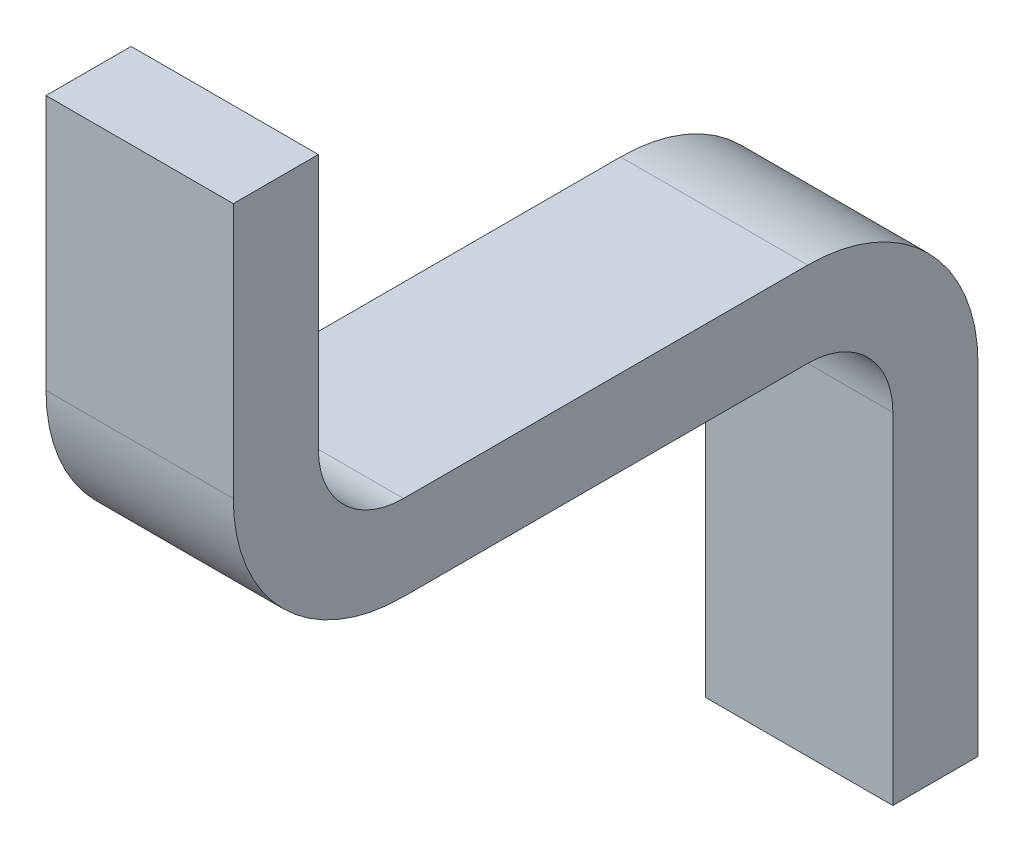
ISO-10303-21;
HEADER;
FILE_DESCRIPTION(('STEP AP214'),'2;1');
FILE_NAME('part.step','',(''),(''),'','','');
FILE_SCHEMA(('AUTOMOTIVE_DESIGN { 1 0 10303 214 1 1 1 1 }'));
ENDSEC;
DATA;
#1=APPLICATION_CONTEXT('core data for automotive mechanical design processes');
#2=APPLICATION_PROTOCOL_DEFINITION('international standard','automotive_design',2000,#1);
#3=PRODUCT_CONTEXT('',#1,'mechanical');
#4=PRODUCT('Part','Part','',(#3));
#5=PRODUCT_RELATED_PRODUCT_CATEGORY('part','',(#4));
#6=PRODUCT_DEFINITION_FORMATION('','',#4);
#7=PRODUCT_DEFINITION_CONTEXT('part definition',#1,'design');
#8=PRODUCT_DEFINITION('design','',#6,#7);
#9=PRODUCT_DEFINITION_SHAPE('','',#8);
#10=(LENGTH_UNIT() NAMED_UNIT(*) SI_UNIT(.MILLI.,.METRE.));
#11=(NAMED_UNIT(*) PLANE_ANGLE_UNIT() SI_UNIT($,.RADIAN.));
#12=(NAMED_UNIT(*) SI_UNIT($,.STERADIAN.) SOLID_ANGLE_UNIT());
#13=UNCERTAINTY_MEASURE_WITH_UNIT(LENGTH_MEASURE(1.E-05),#10,'distance_accuracy_value','');
#14=(GEOMETRIC_REPRESENTATION_CONTEXT(3) GLOBAL_UNCERTAINTY_ASSIGNED_CONTEXT((#13)) GLOBAL_UNIT_ASSIGNED_CONTEXT((#10,
#11,#12)) REPRESENTATION_CONTEXT('',''));
#15=CARTESIAN_POINT('',(0.,0.,0.));
#16=DIRECTION('',(0.,0.,1.));
#17=DIRECTION('',(1.,0.,0.));
#18=AXIS2_PLACEMENT_3D('',#15,#16,#17);
#19=CARTESIAN_POINT('',(-1.36,-4.,0.675));
#20=DIRECTION('',(1.,0.,0.));
#21=DIRECTION('',(0.,1.,0.));
#22=AXIS2_PLACEMENT_3D('',#19,#20,#21);
#23=PLANE('',#22);
#24=CARTESIAN_POINT('',(-1.36,-3.8,0.675));
#25=DIRECTION('',(-1.,0.,0.));
#26=DIRECTION('',(0.,-1.,0.));
#27=AXIS2_PLACEMENT_3D('',#24,#25,#26);
#28=CIRCLE('',#27,0.2);
#29=CARTESIAN_POINT('',(-1.36,-3.8,0.875));
#30=VERTEX_POINT('',#29);
#31=CARTESIAN_POINT('',(-1.36,-4.,0.675));
#32=VERTEX_POINT('',#31);
#33=EDGE_CURVE('E150',#30,#32,#28,.F.);
#34=ORIENTED_EDGE('',*,*,#33,.F.);
#35=DIRECTION('',(0.,1.,0.));
#36=VECTOR('',#35,1.);
#37=CARTESIAN_POINT('',(-1.36,-3.5,0.875));
#38=LINE('',#37,#36);
#39=CARTESIAN_POINT('',(-1.36,-3.5,0.875));
#40=VERTEX_POINT('',#39);
#41=EDGE_CURVE('E147',#30,#40,#38,.T.);
#42=ORIENTED_EDGE('',*,*,#41,.T.);
#43=DIRECTION('',(0.,0.,1.));
#44=VECTOR('',#43,1.);
#45=CARTESIAN_POINT('',(-1.36,-3.5,0.775));
#46=LINE('',#45,#44);
#47=CARTESIAN_POINT('',(-1.36,-3.5,0.775));
#48=VERTEX_POINT('',#47);
#49=EDGE_CURVE('E141',#48,#40,#46,.T.);
#50=ORIENTED_EDGE('',*,*,#49,.F.);
#51=DIRECTION('',(0.,1.,0.));
#52=VECTOR('',#51,1.);
#53=CARTESIAN_POINT('',(-1.36,-3.5,0.775));
#54=LINE('',#53,#52);
#55=CARTESIAN_POINT('',(-1.36,-3.8,0.775));
#56=VERTEX_POINT('',#55);
#57=EDGE_CURVE('E115',#48,#56,#54,.F.);
#58=ORIENTED_EDGE('',*,*,#57,.T.);
#59=CARTESIAN_POINT('',(-1.36,-3.8,0.675));
#60=DIRECTION('',(-1.,0.,0.));
#61=DIRECTION('',(0.,-1.,0.));
#62=AXIS2_PLACEMENT_3D('',#59,#60,#61);
#63=CIRCLE('',#62,0.1);
#64=CARTESIAN_POINT('',(-1.36,-3.9,0.675));
#65=VERTEX_POINT('',#64);
#66=EDGE_CURVE('E215',#56,#65,#63,.F.);
#67=ORIENTED_EDGE('',*,*,#66,.T.);
#68=DIRECTION('',(0.,0.,1.));
#69=VECTOR('',#68,1.);
#70=CARTESIAN_POINT('',(-1.36,-3.9,0.675));
#71=LINE('',#70,#69);
#72=CARTESIAN_POINT('',(-1.36,-3.9,0.2));
#73=VERTEX_POINT('',#72);
#74=EDGE_CURVE('E181',#65,#73,#71,.F.);
#75=ORIENTED_EDGE('',*,*,#74,.T.);
#76=CARTESIAN_POINT('',(-1.36,-4.1,0.2));
#77=DIRECTION('',(1.,0.,0.));
#78=DIRECTION('',(0.,1.,0.));
#79=AXIS2_PLACEMENT_3D('',#76,#77,#78);
#80=CIRCLE('',#79,0.2);
#81=CARTESIAN_POINT('',(-1.36,-4.1,0.));
#82=VERTEX_POINT('',#81);
#83=EDGE_CURVE('E20',#82,#73,#80,.T.);
#84=ORIENTED_EDGE('',*,*,#83,.F.);
#85=DIRECTION('',(0.,1.,0.));
#86=VECTOR('',#85,1.);
#87=CARTESIAN_POINT('',(-1.36,-4.1,0.));
#88=LINE('',#87,#86);
#89=CARTESIAN_POINT('',(-1.36,-4.5,0.));
#90=VERTEX_POINT('',#89);
#91=EDGE_CURVE('E91',#82,#90,#88,.F.);
#92=ORIENTED_EDGE('',*,*,#91,.T.);
#93=DIRECTION('',(0.,0.,1.));
#94=VECTOR('',#93,1.);
#95=CARTESIAN_POINT('',(-1.36,-4.5,0.));
#96=LINE('',#95,#94);
#97=CARTESIAN_POINT('',(-1.36,-4.5,0.1));
#98=VERTEX_POINT('',#97);
#99=EDGE_CURVE('E163',#90,#98,#96,.T.);
#100=ORIENTED_EDGE('',*,*,#99,.T.);
#101=DIRECTION('',(0.,1.,0.));
#102=VECTOR('',#101,1.);
#103=CARTESIAN_POINT('',(-1.36,-4.1,0.1));
#104=LINE('',#103,#102);
#105=CARTESIAN_POINT('',(-1.36,-4.1,0.1));
#106=VERTEX_POINT('',#105);
#107=EDGE_CURVE('E159',#98,#106,#104,.T.);
#108=ORIENTED_EDGE('',*,*,#107,.T.);
#109=CARTESIAN_POINT('',(-1.36,-4.1,0.2));
#110=DIRECTION('',(1.,0.,0.));
#111=DIRECTION('',(0.,1.,0.));
#112=AXIS2_PLACEMENT_3D('',#109,#110,#111);
#113=CIRCLE('',#112,0.1);
#114=CARTESIAN_POINT('',(-1.36,-4.,0.2));
#115=VERTEX_POINT('',#114);
#116=EDGE_CURVE('E155',#106,#115,#113,.T.);
#117=ORIENTED_EDGE('',*,*,#116,.T.);
#118=DIRECTION('',(0.,0.,1.));
#119=VECTOR('',#118,1.);
#120=CARTESIAN_POINT('',(-1.36,-4.,0.675));
#121=LINE('',#120,#119);
#122=EDGE_CURVE('E154',#115,#32,#121,.T.);
#123=ORIENTED_EDGE('',*,*,#122,.T.);
#124=EDGE_LOOP('',(#34,#42,#50,#58,#67,#75,#84,#92,#100,#108,#117,#123));
#125=FACE_BOUND('',#124,.T.);
#126=ADVANCED_FACE('F17',(#125),#23,.F.);
#127=CARTESIAN_POINT('',(-1.36,-4.1,0.2));
#128=DIRECTION('',(1.,0.,0.));
#129=DIRECTION('',(0.,1.,0.));
#130=AXIS2_PLACEMENT_3D('',#127,#128,#129);
#131=CYLINDRICAL_SURFACE('',#130,0.2);
#132=CARTESIAN_POINT('',(-1.14,-4.1,0.2));
#133=DIRECTION('',(1.,0.,0.));
#134=DIRECTION('',(0.,1.,0.));
#135=AXIS2_PLACEMENT_3D('',#132,#133,#134);
#136=CIRCLE('',#135,0.2);
#137=CARTESIAN_POINT('',(-1.14,-3.9,0.2));
#138=VERTEX_POINT('',#137);
#139=CARTESIAN_POINT('',(-1.14,-4.1,0.));
#140=VERTEX_POINT('',#139);
#141=EDGE_CURVE('E183',#138,#140,#136,.F.);
#142=ORIENTED_EDGE('',*,*,#141,.T.);
#143=DIRECTION('',(1.,0.,0.));
#144=VECTOR('',#143,1.);
#145=CARTESIAN_POINT('',(-1.36,-4.1,0.));
#146=LINE('',#145,#144);
#147=EDGE_CURVE('E178',#140,#82,#146,.F.);
#148=ORIENTED_EDGE('',*,*,#147,.T.);
#149=ORIENTED_EDGE('',*,*,#83,.T.);
#150=DIRECTION('',(1.,0.,0.));
#151=VECTOR('',#150,1.);
#152=CARTESIAN_POINT('',(-1.36,-3.9,0.2));
#153=LINE('',#152,#151);
#154=EDGE_CURVE('E217',#73,#138,#153,.T.);
#155=ORIENTED_EDGE('',*,*,#154,.T.);
#156=EDGE_LOOP('',(#142,#148,#149,#155));
#157=FACE_BOUND('',#156,.T.);
#158=ADVANCED_FACE('F254',(#157),#131,.T.);
#159=CARTESIAN_POINT('',(-1.36,-4.1,0.));
#160=DIRECTION('',(0.,0.,1.));
#161=DIRECTION('',(1.,0.,0.));
#162=AXIS2_PLACEMENT_3D('',#159,#160,#161);
#163=PLANE('',#162);
#164=ORIENTED_EDGE('',*,*,#147,.F.);
#165=DIRECTION('',(0.,-1.,0.));
#166=VECTOR('',#165,1.);
#167=CARTESIAN_POINT('',(-1.14,-3.9,0.));
#168=LINE('',#167,#166);
#169=CARTESIAN_POINT('',(-1.14,-4.5,0.));
#170=VERTEX_POINT('',#169);
#171=EDGE_CURVE('E170',#140,#170,#168,.T.);
#172=ORIENTED_EDGE('',*,*,#171,.T.);
#173=DIRECTION('',(-1.,0.,0.));
#174=VECTOR('',#173,1.);
#175=CARTESIAN_POINT('',(-1.36,-4.5,0.));
#176=LINE('',#175,#174);
#177=EDGE_CURVE('E173',#170,#90,#176,.T.);
#178=ORIENTED_EDGE('',*,*,#177,.T.);
#179=ORIENTED_EDGE('',*,*,#91,.F.);
#180=EDGE_LOOP('',(#164,#172,#178,#179));
#181=FACE_BOUND('',#180,.T.);
#182=ADVANCED_FACE('F257',(#181),#163,.F.);
#183=CARTESIAN_POINT('',(-1.36,-4.5,0.));
#184=DIRECTION('',(0.,1.,0.));
#185=DIRECTION('',(-1.,0.,0.));
#186=AXIS2_PLACEMENT_3D('',#183,#184,#185);
#187=PLANE('',#186);
#188=DIRECTION('',(-1.,0.,0.));
#189=VECTOR('',#188,1.);
#190=CARTESIAN_POINT('',(-1.14,-4.5,0.1));
#191=LINE('',#190,#189);
#192=CARTESIAN_POINT('',(-1.14,-4.5,0.1));
#193=VERTEX_POINT('',#192);
#194=EDGE_CURVE('E160',#193,#98,#191,.T.);
#195=ORIENTED_EDGE('',*,*,#194,.T.);
#196=ORIENTED_EDGE('',*,*,#99,.F.);
#197=ORIENTED_EDGE('',*,*,#177,.F.);
#198=DIRECTION('',(0.,0.,1.));
#199=VECTOR('',#198,1.);
#200=CARTESIAN_POINT('',(-1.14,-4.5,0.675));
#201=LINE('',#200,#199);
#202=EDGE_CURVE('E166',#170,#193,#201,.T.);
#203=ORIENTED_EDGE('',*,*,#202,.T.);
#204=EDGE_LOOP('',(#195,#196,#197,#203));
#205=FACE_BOUND('',#204,.T.);
#206=ADVANCED_FACE('F259',(#205),#187,.F.);
#207=CARTESIAN_POINT('',(-1.14,-4.1,0.1));
#208=DIRECTION('',(0.,0.,-1.));
#209=DIRECTION('',(-1.,0.,0.));
#210=AXIS2_PLACEMENT_3D('',#207,#208,#209);
#211=PLANE('',#210);
#212=DIRECTION('',(1.,0.,0.));
#213=VECTOR('',#212,1.);
#214=CARTESIAN_POINT('',(-1.14,-4.1,0.1));
#215=LINE('',#214,#213);
#216=CARTESIAN_POINT('',(-1.14,-4.1,0.1));
#217=VERTEX_POINT('',#216);
#218=EDGE_CURVE('E156',#217,#106,#215,.F.);
#219=ORIENTED_EDGE('',*,*,#218,.T.);
#220=ORIENTED_EDGE('',*,*,#107,.F.);
#221=ORIENTED_EDGE('',*,*,#194,.F.);
#222=DIRECTION('',(0.,-1.,0.));
#223=VECTOR('',#222,1.);
#224=CARTESIAN_POINT('',(-1.14,-3.9,0.1));
#225=LINE('',#224,#223);
#226=EDGE_CURVE('E169',#193,#217,#225,.F.);
#227=ORIENTED_EDGE('',*,*,#226,.T.);
#228=EDGE_LOOP('',(#219,#220,#221,#227));
#229=FACE_BOUND('',#228,.T.);
#230=ADVANCED_FACE('F234',(#229),#211,.F.);
#231=CARTESIAN_POINT('',(-1.14,-4.1,0.2));
#232=DIRECTION('',(1.,0.,0.));
#233=DIRECTION('',(0.,1.,0.));
#234=AXIS2_PLACEMENT_3D('',#231,#232,#233);
#235=CYLINDRICAL_SURFACE('',#234,0.1);
#236=DIRECTION('',(-1.,0.,0.));
#237=VECTOR('',#236,1.);
#238=CARTESIAN_POINT('',(-1.14,-4.,0.2));
#239=LINE('',#238,#237);
#240=CARTESIAN_POINT('',(-1.14,-4.,0.2));
#241=VERTEX_POINT('',#240);
#242=EDGE_CURVE('E151',#241,#115,#239,.T.);
#243=ORIENTED_EDGE('',*,*,#242,.T.);
#244=ORIENTED_EDGE('',*,*,#116,.F.);
#245=ORIENTED_EDGE('',*,*,#218,.F.);
#246=CARTESIAN_POINT('',(-1.14,-4.1,0.2));
#247=DIRECTION('',(1.,0.,0.));
#248=DIRECTION('',(0.,1.,0.));
#249=AXIS2_PLACEMENT_3D('',#246,#247,#248);
#250=CIRCLE('',#249,0.1);
#251=EDGE_CURVE('E210',#217,#241,#250,.T.);
#252=ORIENTED_EDGE('',*,*,#251,.T.);
#253=EDGE_LOOP('',(#243,#244,#245,#252));
#254=FACE_BOUND('',#253,.T.);
#255=ADVANCED_FACE('F227',(#254),#235,.F.);
#256=CARTESIAN_POINT('',(-1.14,-4.,0.675));
#257=DIRECTION('',(0.,1.,0.));
#258=DIRECTION('',(-1.,0.,0.));
#259=AXIS2_PLACEMENT_3D('',#256,#257,#258);
#260=PLANE('',#259);
#261=DIRECTION('',(-1.,0.,0.));
#262=VECTOR('',#261,1.);
#263=CARTESIAN_POINT('',(-1.14,-4.,0.675));
#264=LINE('',#263,#262);
#265=CARTESIAN_POINT('',(-1.14,-4.,0.675));
#266=VERTEX_POINT('',#265);
#267=EDGE_CURVE('E148',#32,#266,#264,.F.);
#268=ORIENTED_EDGE('',*,*,#267,.F.);
#269=ORIENTED_EDGE('',*,*,#122,.F.);
#270=ORIENTED_EDGE('',*,*,#242,.F.);
#271=DIRECTION('',(0.,0.,1.));
#272=VECTOR('',#271,1.);
#273=CARTESIAN_POINT('',(-1.14,-4.,0.675));
#274=LINE('',#273,#272);
#275=EDGE_CURVE('E209',#241,#266,#274,.T.);
#276=ORIENTED_EDGE('',*,*,#275,.T.);
#277=EDGE_LOOP('',(#268,#269,#270,#276));
#278=FACE_BOUND('',#277,.T.);
#279=ADVANCED_FACE('F224',(#278),#260,.F.);
#280=CARTESIAN_POINT('',(-1.14,-3.80000000000001,0.675));
#281=DIRECTION('',(-1.,0.,0.));
#282=DIRECTION('',(0.,-1.,0.));
#283=AXIS2_PLACEMENT_3D('',#280,#281,#282);
#284=CYLINDRICAL_SURFACE('',#283,0.2);
#285=ORIENTED_EDGE('',*,*,#33,.T.);
#286=ORIENTED_EDGE('',*,*,#267,.T.);
#287=CARTESIAN_POINT('',(-1.14,-3.80000000000001,0.675));
#288=DIRECTION('',(-1.,0.,0.));
#289=DIRECTION('',(0.,-1.,0.));
#290=AXIS2_PLACEMENT_3D('',#287,#288,#289);
#291=CIRCLE('',#290,0.2);
#292=CARTESIAN_POINT('',(-1.14,-3.80000000000001,0.875));
#293=VERTEX_POINT('',#292);
#294=EDGE_CURVE('E133',#266,#293,#291,.T.);
#295=ORIENTED_EDGE('',*,*,#294,.T.);
#296=DIRECTION('',(-1.,0.,0.));
#297=VECTOR('',#296,1.);
#298=CARTESIAN_POINT('',(-1.14,-3.80000000000001,0.875));
#299=LINE('',#298,#297);
#300=EDGE_CURVE('E144',#293,#30,#299,.T.);
#301=ORIENTED_EDGE('',*,*,#300,.T.);
#302=EDGE_LOOP('',(#285,#286,#295,#301));
#303=FACE_BOUND('',#302,.T.);
#304=ADVANCED_FACE('F285',(#303),#284,.T.);
#305=CARTESIAN_POINT('',(-1.14,-3.5,0.875));
#306=DIRECTION('',(0.,0.,-1.));
#307=DIRECTION('',(-1.,0.,0.));
#308=AXIS2_PLACEMENT_3D('',#305,#306,#307);
#309=PLANE('',#308);
#310=DIRECTION('',(-1.,0.,0.));
#311=VECTOR('',#310,1.);
#312=CARTESIAN_POINT('',(-1.36,-3.5,0.875));
#313=LINE('',#312,#311);
#314=CARTESIAN_POINT('',(-1.14,-3.5,0.875));
#315=VERTEX_POINT('',#314);
#316=EDGE_CURVE('E118',#40,#315,#313,.F.);
#317=ORIENTED_EDGE('',*,*,#316,.F.);
#318=ORIENTED_EDGE('',*,*,#41,.F.);
#319=ORIENTED_EDGE('',*,*,#300,.F.);
#320=DIRECTION('',(0.,-1.,0.));
#321=VECTOR('',#320,1.);
#322=CARTESIAN_POINT('',(-1.14,-3.9,0.875));
#323=LINE('',#322,#321);
#324=EDGE_CURVE('E131',#293,#315,#323,.F.);
#325=ORIENTED_EDGE('',*,*,#324,.T.);
#326=EDGE_LOOP('',(#317,#318,#319,#325));
#327=FACE_BOUND('',#326,.T.);
#328=ADVANCED_FACE('F282',(#327),#309,.F.);
#329=CARTESIAN_POINT('',(-1.36,-3.5,0.775));
#330=DIRECTION('',(0.,1.,0.));
#331=DIRECTION('',(-1.,0.,0.));
#332=AXIS2_PLACEMENT_3D('',#329,#330,#331);
#333=PLANE('',#332);
#334=ORIENTED_EDGE('',*,*,#49,.T.);
#335=ORIENTED_EDGE('',*,*,#316,.T.);
#336=DIRECTION('',(0.,0.,1.));
#337=VECTOR('',#336,1.);
#338=CARTESIAN_POINT('',(-1.14,-3.5,0.675));
#339=LINE('',#338,#337);
#340=CARTESIAN_POINT('',(-1.14,-3.5,0.775));
#341=VERTEX_POINT('',#340);
#342=EDGE_CURVE('E125',#315,#341,#339,.F.);
#343=ORIENTED_EDGE('',*,*,#342,.T.);
#344=DIRECTION('',(1.,0.,0.));
#345=VECTOR('',#344,1.);
#346=CARTESIAN_POINT('',(-1.36,-3.5,0.775));
#347=LINE('',#346,#345);
#348=EDGE_CURVE('E110',#341,#48,#347,.F.);
#349=ORIENTED_EDGE('',*,*,#348,.T.);
#350=EDGE_LOOP('',(#334,#335,#343,#349));
#351=FACE_BOUND('',#350,.T.);
#352=ADVANCED_FACE('F129',(#351),#333,.T.);
#353=CARTESIAN_POINT('',(-1.36,-3.5,0.775));
#354=DIRECTION('',(0.,0.,1.));
#355=DIRECTION('',(1.,0.,0.));
#356=AXIS2_PLACEMENT_3D('',#353,#354,#355);
#357=PLANE('',#356);
#358=ORIENTED_EDGE('',*,*,#348,.F.);
#359=DIRECTION('',(0.,-1.,0.));
#360=VECTOR('',#359,1.);
#361=CARTESIAN_POINT('',(-1.14,-3.9,0.775));
#362=LINE('',#361,#360);
#363=CARTESIAN_POINT('',(-1.14,-3.80000000000001,0.775));
#364=VERTEX_POINT('',#363);
#365=EDGE_CURVE('E114',#341,#364,#362,.T.);
#366=ORIENTED_EDGE('',*,*,#365,.T.);
#367=DIRECTION('',(-1.,0.,0.));
#368=VECTOR('',#367,1.);
#369=CARTESIAN_POINT('',(-1.36,-3.8,0.775));
#370=LINE('',#369,#368);
#371=EDGE_CURVE('E185',#364,#56,#370,.T.);
#372=ORIENTED_EDGE('',*,*,#371,.T.);
#373=ORIENTED_EDGE('',*,*,#57,.F.);
#374=EDGE_LOOP('',(#358,#366,#372,#373));
#375=FACE_BOUND('',#374,.T.);
#376=ADVANCED_FACE('F112',(#375),#357,.F.);
#377=CARTESIAN_POINT('',(-1.36,-3.8,0.675));
#378=DIRECTION('',(-1.,0.,0.));
#379=DIRECTION('',(0.,-1.,0.));
#380=AXIS2_PLACEMENT_3D('',#377,#378,#379);
#381=CYLINDRICAL_SURFACE('',#380,0.1);
#382=ORIENTED_EDGE('',*,*,#371,.F.);
#383=CARTESIAN_POINT('',(-1.14,-3.80000000000001,0.675));
#384=DIRECTION('',(-1.,0.,0.));
#385=DIRECTION('',(0.,-1.,0.));
#386=AXIS2_PLACEMENT_3D('',#383,#384,#385);
#387=CIRCLE('',#386,0.1);
#388=CARTESIAN_POINT('',(-1.14,-3.9,0.675));
#389=VERTEX_POINT('',#388);
#390=EDGE_CURVE('E26',#364,#389,#387,.F.);
#391=ORIENTED_EDGE('',*,*,#390,.T.);
#392=DIRECTION('',(1.,0.,0.));
#393=VECTOR('',#392,1.);
#394=CARTESIAN_POINT('',(-1.36,-3.9,0.675));
#395=LINE('',#394,#393);
#396=EDGE_CURVE('E34',#389,#65,#395,.F.);
#397=ORIENTED_EDGE('',*,*,#396,.T.);
#398=ORIENTED_EDGE('',*,*,#66,.F.);
#399=EDGE_LOOP('',(#382,#391,#397,#398));
#400=FACE_BOUND('',#399,.T.);
#401=ADVANCED_FACE('F250',(#400),#381,.F.);
#402=CARTESIAN_POINT('',(-1.36,-3.9,0.675));
#403=DIRECTION('',(0.,-1.,0.));
#404=DIRECTION('',(1.,0.,0.));
#405=AXIS2_PLACEMENT_3D('',#402,#403,#404);
#406=PLANE('',#405);
#407=ORIENTED_EDGE('',*,*,#396,.F.);
#408=DIRECTION('',(0.,0.,1.));
#409=VECTOR('',#408,1.);
#410=CARTESIAN_POINT('',(-1.14,-3.9,0.675));
#411=LINE('',#410,#409);
#412=EDGE_CURVE('E11',#389,#138,#411,.F.);
#413=ORIENTED_EDGE('',*,*,#412,.T.);
#414=ORIENTED_EDGE('',*,*,#154,.F.);
#415=ORIENTED_EDGE('',*,*,#74,.F.);
#416=EDGE_LOOP('',(#407,#413,#414,#415));
#417=FACE_BOUND('',#416,.T.);
#418=ADVANCED_FACE('F252',(#417),#406,.F.);
#419=CARTESIAN_POINT('',(-1.14,-3.9,0.675));
#420=DIRECTION('',(-1.,0.,0.));
#421=DIRECTION('',(0.,-1.,0.));
#422=AXIS2_PLACEMENT_3D('',#419,#420,#421);
#423=PLANE('',#422);
#424=ORIENTED_EDGE('',*,*,#390,.F.);
#425=ORIENTED_EDGE('',*,*,#365,.F.);
#426=ORIENTED_EDGE('',*,*,#342,.F.);
#427=ORIENTED_EDGE('',*,*,#324,.F.);
#428=ORIENTED_EDGE('',*,*,#294,.F.);
#429=ORIENTED_EDGE('',*,*,#275,.F.);
#430=ORIENTED_EDGE('',*,*,#251,.F.);
#431=ORIENTED_EDGE('',*,*,#226,.F.);
#432=ORIENTED_EDGE('',*,*,#202,.F.);
#433=ORIENTED_EDGE('',*,*,#171,.F.);
#434=ORIENTED_EDGE('',*,*,#141,.F.);
#435=ORIENTED_EDGE('',*,*,#412,.F.);
#436=EDGE_LOOP('',(#424,#425,#426,#427,#428,#429,#430,#431,#432,#433,#434,#435));
#437=FACE_BOUND('',#436,.T.);
#438=ADVANCED_FACE('F123',(#437),#423,.F.);
#439=CLOSED_SHELL('',(#126,#158,#182,#206,#230,#255,#279,#304,#328,#352,#376,#401,#418,#438));
#440=MANIFOLD_SOLID_BREP('B1',#439);
#441=ADVANCED_BREP_SHAPE_REPRESENTATION('',(#18,#440),#14);
#442=SHAPE_DEFINITION_REPRESENTATION(#9,#441);
ENDSEC;
END-ISO-10303-21;
